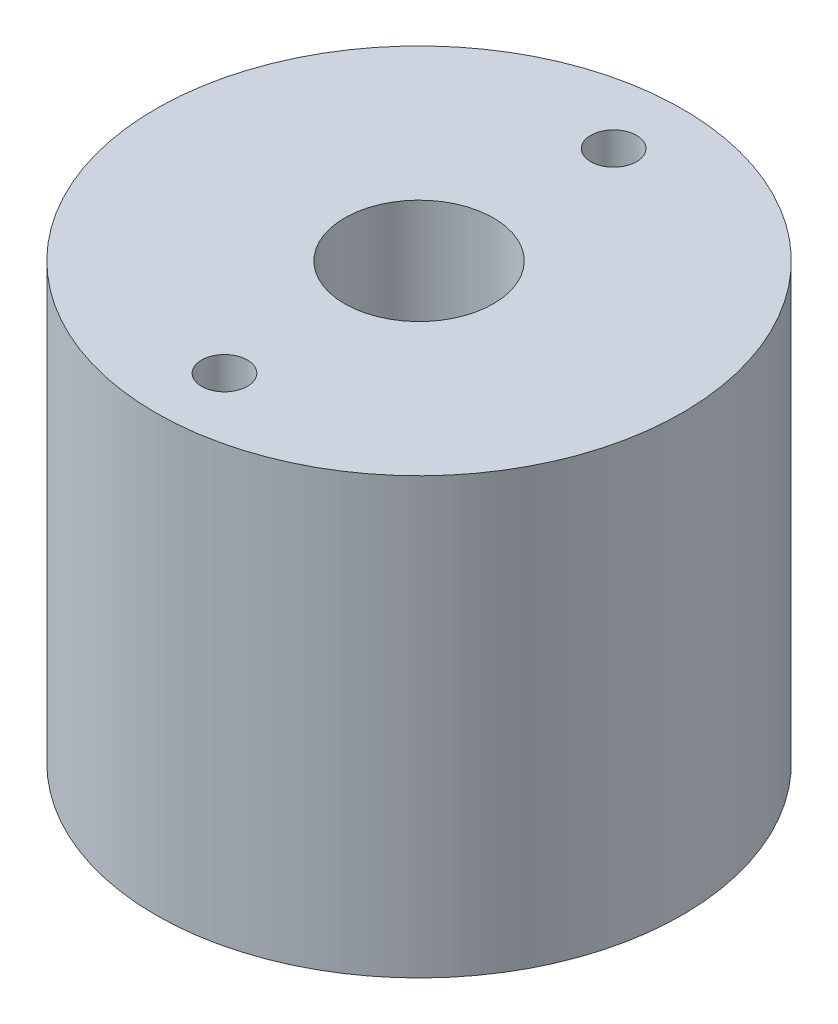
ISO-10303-21;
HEADER;
FILE_DESCRIPTION(('STEP AP214'),'2;1');
FILE_NAME('part.step','',(''),(''),'','','');
FILE_SCHEMA(('AUTOMOTIVE_DESIGN { 1 0 10303 214 1 1 1 1 }'));
ENDSEC;
DATA;
#1=APPLICATION_CONTEXT('core data for automotive mechanical design processes');
#2=APPLICATION_PROTOCOL_DEFINITION('international standard','automotive_design',2000,#1);
#3=PRODUCT_CONTEXT('',#1,'mechanical');
#4=PRODUCT('Part','Part','',(#3));
#5=PRODUCT_RELATED_PRODUCT_CATEGORY('part','',(#4));
#6=PRODUCT_DEFINITION_FORMATION('','',#4);
#7=PRODUCT_DEFINITION_CONTEXT('part definition',#1,'design');
#8=PRODUCT_DEFINITION('design','',#6,#7);
#9=PRODUCT_DEFINITION_SHAPE('','',#8);
#10=(LENGTH_UNIT() NAMED_UNIT(*) SI_UNIT(.MILLI.,.METRE.));
#11=(NAMED_UNIT(*) PLANE_ANGLE_UNIT() SI_UNIT($,.RADIAN.));
#12=(NAMED_UNIT(*) SI_UNIT($,.STERADIAN.) SOLID_ANGLE_UNIT());
#13=UNCERTAINTY_MEASURE_WITH_UNIT(LENGTH_MEASURE(1.E-05),#10,'distance_accuracy_value','');
#14=(GEOMETRIC_REPRESENTATION_CONTEXT(3) GLOBAL_UNCERTAINTY_ASSIGNED_CONTEXT((#13)) GLOBAL_UNIT_ASSIGNED_CONTEXT((#10,
#11,#12)) REPRESENTATION_CONTEXT('',''));
#15=CARTESIAN_POINT('',(0.,0.,0.));
#16=DIRECTION('',(0.,0.,1.));
#17=DIRECTION('',(1.,0.,0.));
#18=AXIS2_PLACEMENT_3D('',#15,#16,#17);
#19=CARTESIAN_POINT('',(0.,19.,0.));
#20=DIRECTION('',(0.,-1.,0.));
#21=DIRECTION('',(0.,0.,-1.));
#22=AXIS2_PLACEMENT_3D('',#19,#20,#21);
#23=CYLINDRICAL_SURFACE('',#22,11.5);
#24=CARTESIAN_POINT('',(0.,19.,0.));
#25=DIRECTION('',(0.,1.,0.));
#26=DIRECTION('',(0.,0.,1.));
#27=AXIS2_PLACEMENT_3D('',#24,#25,#26);
#28=CIRCLE('',#27,11.5);
#29=CARTESIAN_POINT('',(0.,19.,11.5));
#30=VERTEX_POINT('',#29);
#31=EDGE_CURVE('E10',#30,#30,#28,.T.);
#32=ORIENTED_EDGE('',*,*,#31,.F.);
#33=EDGE_LOOP('',(#32));
#34=FACE_BOUND('',#33,.T.);
#35=CARTESIAN_POINT('',(0.,0.,0.));
#36=DIRECTION('',(0.,1.,0.));
#37=DIRECTION('',(0.,0.,1.));
#38=AXIS2_PLACEMENT_3D('',#35,#36,#37);
#39=CIRCLE('',#38,11.5);
#40=CARTESIAN_POINT('',(0.,0.,11.5));
#41=VERTEX_POINT('',#40);
#42=EDGE_CURVE('E33',#41,#41,#39,.T.);
#43=ORIENTED_EDGE('',*,*,#42,.T.);
#44=EDGE_LOOP('',(#43));
#45=FACE_BOUND('',#44,.T.);
#46=ADVANCED_FACE('F30',(#34,#45),#23,.T.);
#47=CARTESIAN_POINT('',(0.,19.,0.));
#48=DIRECTION('',(0.,1.,0.));
#49=DIRECTION('',(0.,0.,1.));
#50=AXIS2_PLACEMENT_3D('',#47,#48,#49);
#51=PLANE('',#50);
#52=CARTESIAN_POINT('',(0.,19.,8.5));
#53=DIRECTION('',(0.,1.,0.));
#54=DIRECTION('',(0.,0.,1.));
#55=AXIS2_PLACEMENT_3D('',#52,#53,#54);
#56=CIRCLE('',#55,1.);
#57=CARTESIAN_POINT('',(0.,19.,9.5));
#58=VERTEX_POINT('',#57);
#59=EDGE_CURVE('E54',#58,#58,#56,.T.);
#60=ORIENTED_EDGE('',*,*,#59,.F.);
#61=EDGE_LOOP('',(#60));
#62=FACE_BOUND('',#61,.T.);
#63=CARTESIAN_POINT('',(0.,19.,-8.5));
#64=DIRECTION('',(0.,1.,0.));
#65=DIRECTION('',(0.,0.,1.));
#66=AXIS2_PLACEMENT_3D('',#63,#64,#65);
#67=CIRCLE('',#66,1.);
#68=CARTESIAN_POINT('',(0.,19.,-7.5));
#69=VERTEX_POINT('',#68);
#70=EDGE_CURVE('E48',#69,#69,#67,.T.);
#71=ORIENTED_EDGE('',*,*,#70,.F.);
#72=EDGE_LOOP('',(#71));
#73=FACE_BOUND('',#72,.T.);
#74=CARTESIAN_POINT('',(0.,19.,0.));
#75=DIRECTION('',(0.,1.,0.));
#76=DIRECTION('',(0.,0.,1.));
#77=AXIS2_PLACEMENT_3D('',#74,#75,#76);
#78=CIRCLE('',#77,3.25);
#79=CARTESIAN_POINT('',(0.,19.,3.25));
#80=VERTEX_POINT('',#79);
#81=EDGE_CURVE('E42',#80,#80,#78,.T.);
#82=ORIENTED_EDGE('',*,*,#81,.F.);
#83=EDGE_LOOP('',(#82));
#84=FACE_BOUND('',#83,.T.);
#85=ORIENTED_EDGE('',*,*,#31,.T.);
#86=EDGE_LOOP('',(#85));
#87=FACE_BOUND('',#86,.T.);
#88=ADVANCED_FACE('F69',(#62,#73,#84,#87),#51,.T.);
#89=CARTESIAN_POINT('',(0.,0.,0.));
#90=DIRECTION('',(0.,1.,0.));
#91=DIRECTION('',(0.,0.,1.));
#92=AXIS2_PLACEMENT_3D('',#89,#90,#91);
#93=PLANE('',#92);
#94=ORIENTED_EDGE('',*,*,#42,.F.);
#95=EDGE_LOOP('',(#94));
#96=FACE_BOUND('',#95,.T.);
#97=ADVANCED_FACE('F72',(#96),#93,.F.);
#98=CARTESIAN_POINT('',(0.,10.5,0.));
#99=DIRECTION('',(0.,1.,0.));
#100=DIRECTION('',(0.,0.,1.));
#101=AXIS2_PLACEMENT_3D('',#98,#99,#100);
#102=CYLINDRICAL_SURFACE('',#101,3.25);
#103=CARTESIAN_POINT('',(0.,10.5,0.));
#104=DIRECTION('',(0.,1.,0.));
#105=DIRECTION('',(0.,0.,1.));
#106=AXIS2_PLACEMENT_3D('',#103,#104,#105);
#107=CIRCLE('',#106,3.25);
#108=CARTESIAN_POINT('',(0.,10.5,3.25));
#109=VERTEX_POINT('',#108);
#110=EDGE_CURVE('E45',#109,#109,#107,.T.);
#111=ORIENTED_EDGE('',*,*,#110,.F.);
#112=EDGE_LOOP('',(#111));
#113=FACE_BOUND('',#112,.T.);
#114=ORIENTED_EDGE('',*,*,#81,.T.);
#115=EDGE_LOOP('',(#114));
#116=FACE_BOUND('',#115,.T.);
#117=ADVANCED_FACE('F78',(#113,#116),#102,.F.);
#118=CARTESIAN_POINT('',(0.,10.5,0.));
#119=DIRECTION('',(0.,1.,0.));
#120=DIRECTION('',(0.,0.,1.));
#121=AXIS2_PLACEMENT_3D('',#118,#119,#120);
#122=PLANE('',#121);
#123=ORIENTED_EDGE('',*,*,#110,.T.);
#124=EDGE_LOOP('',(#123));
#125=FACE_BOUND('',#124,.T.);
#126=ADVANCED_FACE('F80',(#125),#122,.T.);
#127=CARTESIAN_POINT('',(0.,10.5,-8.5));
#128=DIRECTION('',(0.,1.,0.));
#129=DIRECTION('',(0.,0.,1.));
#130=AXIS2_PLACEMENT_3D('',#127,#128,#129);
#131=CYLINDRICAL_SURFACE('',#130,1.);
#132=CARTESIAN_POINT('',(0.,10.5,-8.5));
#133=DIRECTION('',(0.,1.,0.));
#134=DIRECTION('',(0.,0.,1.));
#135=AXIS2_PLACEMENT_3D('',#132,#133,#134);
#136=CIRCLE('',#135,1.);
#137=CARTESIAN_POINT('',(0.,10.5,-7.5));
#138=VERTEX_POINT('',#137);
#139=EDGE_CURVE('E51',#138,#138,#136,.T.);
#140=ORIENTED_EDGE('',*,*,#139,.F.);
#141=EDGE_LOOP('',(#140));
#142=FACE_BOUND('',#141,.T.);
#143=ORIENTED_EDGE('',*,*,#70,.T.);
#144=EDGE_LOOP('',(#143));
#145=FACE_BOUND('',#144,.T.);
#146=ADVANCED_FACE('F87',(#142,#145),#131,.F.);
#147=CARTESIAN_POINT('',(0.,10.5,-8.5));
#148=DIRECTION('',(0.,1.,0.));
#149=DIRECTION('',(0.,0.,1.));
#150=AXIS2_PLACEMENT_3D('',#147,#148,#149);
#151=PLANE('',#150);
#152=ORIENTED_EDGE('',*,*,#139,.T.);
#153=EDGE_LOOP('',(#152));
#154=FACE_BOUND('',#153,.T.);
#155=ADVANCED_FACE('F65',(#154),#151,.T.);
#156=CARTESIAN_POINT('',(0.,10.5,8.5));
#157=DIRECTION('',(0.,1.,0.));
#158=DIRECTION('',(0.,0.,1.));
#159=AXIS2_PLACEMENT_3D('',#156,#157,#158);
#160=CYLINDRICAL_SURFACE('',#159,1.);
#161=CARTESIAN_POINT('',(0.,10.5,8.5));
#162=DIRECTION('',(0.,1.,0.));
#163=DIRECTION('',(0.,0.,1.));
#164=AXIS2_PLACEMENT_3D('',#161,#162,#163);
#165=CIRCLE('',#164,1.);
#166=CARTESIAN_POINT('',(0.,10.5,9.5));
#167=VERTEX_POINT('',#166);
#168=EDGE_CURVE('E40',#167,#167,#165,.T.);
#169=ORIENTED_EDGE('',*,*,#168,.F.);
#170=EDGE_LOOP('',(#169));
#171=FACE_BOUND('',#170,.T.);
#172=ORIENTED_EDGE('',*,*,#59,.T.);
#173=EDGE_LOOP('',(#172));
#174=FACE_BOUND('',#173,.T.);
#175=ADVANCED_FACE('F62',(#171,#174),#160,.F.);
#176=CARTESIAN_POINT('',(0.,10.5,8.5));
#177=DIRECTION('',(0.,1.,0.));
#178=DIRECTION('',(0.,0.,1.));
#179=AXIS2_PLACEMENT_3D('',#176,#177,#178);
#180=PLANE('',#179);
#181=ORIENTED_EDGE('',*,*,#168,.T.);
#182=EDGE_LOOP('',(#181));
#183=FACE_BOUND('',#182,.T.);
#184=ADVANCED_FACE('F60',(#183),#180,.T.);
#185=CLOSED_SHELL('',(#46,#88,#97,#117,#126,#146,#155,#175,#184));
#186=MANIFOLD_SOLID_BREP('B2',#185);
#187=ADVANCED_BREP_SHAPE_REPRESENTATION('',(#18,#186),#14);
#188=SHAPE_DEFINITION_REPRESENTATION(#9,#187);
ENDSEC;
END-ISO-10303-21;
